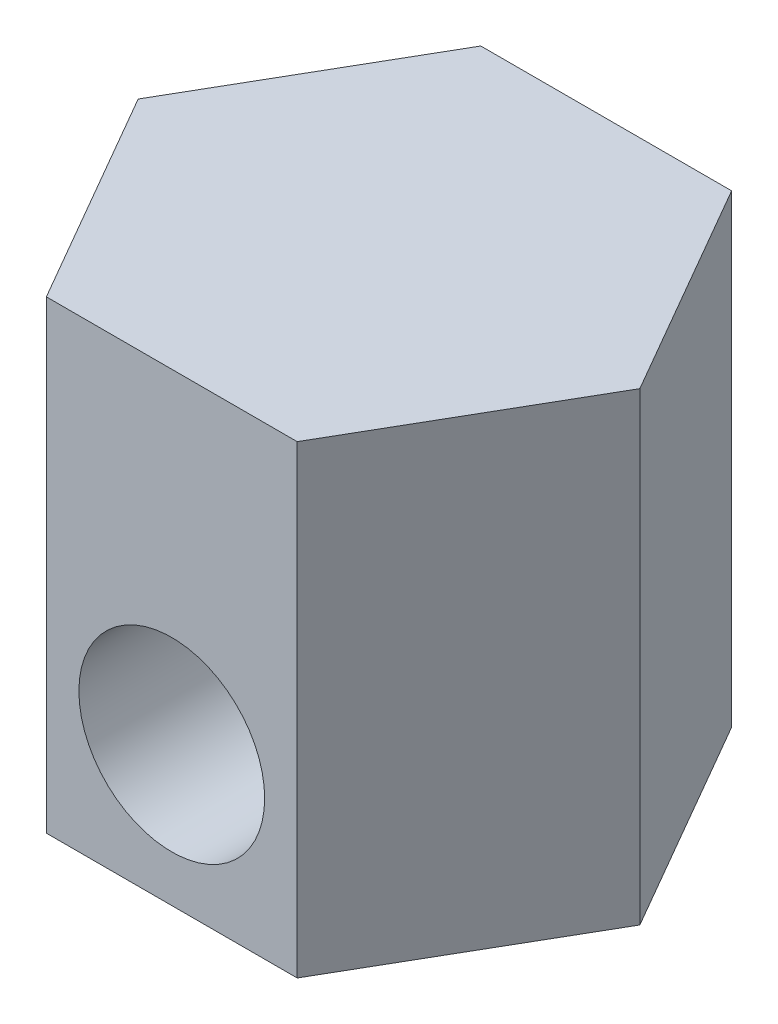
ISO-10303-21;
HEADER;
FILE_DESCRIPTION(('STEP AP214'),'2;1');
FILE_NAME('part.step','',(''),(''),'','','');
FILE_SCHEMA(('AUTOMOTIVE_DESIGN { 1 0 10303 214 1 1 1 1 }'));
ENDSEC;
DATA;
#1=APPLICATION_CONTEXT('core data for automotive mechanical design processes');
#2=APPLICATION_PROTOCOL_DEFINITION('international standard','automotive_design',2000,#1);
#3=PRODUCT_CONTEXT('',#1,'mechanical');
#4=PRODUCT('Part','Part','',(#3));
#5=PRODUCT_RELATED_PRODUCT_CATEGORY('part','',(#4));
#6=PRODUCT_DEFINITION_FORMATION('','',#4);
#7=PRODUCT_DEFINITION_CONTEXT('part definition',#1,'design');
#8=PRODUCT_DEFINITION('design','',#6,#7);
#9=PRODUCT_DEFINITION_SHAPE('','',#8);
#10=(LENGTH_UNIT() NAMED_UNIT(*) SI_UNIT(.MILLI.,.METRE.));
#11=(NAMED_UNIT(*) PLANE_ANGLE_UNIT() SI_UNIT($,.RADIAN.));
#12=(NAMED_UNIT(*) SI_UNIT($,.STERADIAN.) SOLID_ANGLE_UNIT());
#13=UNCERTAINTY_MEASURE_WITH_UNIT(LENGTH_MEASURE(1.E-05),#10,'distance_accuracy_value','');
#14=(GEOMETRIC_REPRESENTATION_CONTEXT(3) GLOBAL_UNCERTAINTY_ASSIGNED_CONTEXT((#13)) GLOBAL_UNIT_ASSIGNED_CONTEXT((#10,
#11,#12)) REPRESENTATION_CONTEXT('',''));
#15=CARTESIAN_POINT('',(0.,0.,0.));
#16=DIRECTION('',(0.,0.,1.));
#17=DIRECTION('',(1.,0.,0.));
#18=AXIS2_PLACEMENT_3D('',#15,#16,#17);
#19=CARTESIAN_POINT('',(0.,1.,-2.33826859021799));
#20=DIRECTION('',(0.,0.,1.));
#21=DIRECTION('',(1.,0.,0.));
#22=AXIS2_PLACEMENT_3D('',#19,#20,#21);
#23=CYLINDRICAL_SURFACE('',#22,0.5);
#24=CARTESIAN_POINT('',(0.,1.,-2.33826859021799));
#25=DIRECTION('',(0.,0.,1.));
#26=DIRECTION('',(1.,0.,0.));
#27=AXIS2_PLACEMENT_3D('',#24,#25,#26);
#28=CIRCLE('',#27,0.5);
#29=CARTESIAN_POINT('',(0.5,1.,-2.33826859021799));
#30=VERTEX_POINT('',#29);
#31=EDGE_CURVE('E128',#30,#30,#28,.T.);
#32=ORIENTED_EDGE('',*,*,#31,.F.);
#33=EDGE_LOOP('',(#32));
#34=FACE_BOUND('',#33,.T.);
#35=CARTESIAN_POINT('',(0.,1.,0.338268590217985));
#36=DIRECTION('',(0.,0.,1.));
#37=DIRECTION('',(1.,0.,0.));
#38=AXIS2_PLACEMENT_3D('',#35,#36,#37);
#39=CIRCLE('',#38,0.5);
#40=CARTESIAN_POINT('',(0.,0.5,0.338268590217985));
#41=VERTEX_POINT('',#40);
#42=EDGE_CURVE('E11',#41,#41,#39,.F.);
#43=ORIENTED_EDGE('',*,*,#42,.F.);
#44=EDGE_LOOP('',(#43));
#45=FACE_BOUND('',#44,.T.);
#46=ADVANCED_FACE('F33',(#34,#45),#23,.F.);
#47=CARTESIAN_POINT('',(1.35,5.,2.33826859021799));
#48=DIRECTION('',(-0.866025403784439,0.,-0.5));
#49=DIRECTION('',(-0.5,0.,0.866025403784439));
#50=AXIS2_PLACEMENT_3D('',#47,#48,#49);
#51=PLANE('',#50);
#52=DIRECTION('',(0.5,0.,-0.866025403784439));
#53=VECTOR('',#52,1.);
#54=CARTESIAN_POINT('',(1.35,0.,2.33826859021799));
#55=LINE('',#54,#53);
#56=CARTESIAN_POINT('',(1.35,0.,2.33826859021799));
#57=VERTEX_POINT('',#56);
#58=CARTESIAN_POINT('',(2.7,0.,0.));
#59=VERTEX_POINT('',#58);
#60=EDGE_CURVE('E124',#57,#59,#55,.T.);
#61=ORIENTED_EDGE('',*,*,#60,.T.);
#62=DIRECTION('',(0.,-1.,0.));
#63=VECTOR('',#62,1.);
#64=CARTESIAN_POINT('',(2.7,5.,0.));
#65=LINE('',#64,#63);
#66=CARTESIAN_POINT('',(2.7,5.,0.));
#67=VERTEX_POINT('',#66);
#68=EDGE_CURVE('E41',#67,#59,#65,.T.);
#69=ORIENTED_EDGE('',*,*,#68,.F.);
#70=DIRECTION('',(0.5,0.,-0.866025403784439));
#71=VECTOR('',#70,1.);
#72=CARTESIAN_POINT('',(1.35,5.,2.33826859021799));
#73=LINE('',#72,#71);
#74=CARTESIAN_POINT('',(1.35,5.,2.33826859021799));
#75=VERTEX_POINT('',#74);
#76=EDGE_CURVE('E136',#75,#67,#73,.T.);
#77=ORIENTED_EDGE('',*,*,#76,.F.);
#78=DIRECTION('',(0.,-1.,0.));
#79=VECTOR('',#78,1.);
#80=CARTESIAN_POINT('',(1.35,5.,2.33826859021799));
#81=LINE('',#80,#79);
#82=EDGE_CURVE('E120',#75,#57,#81,.T.);
#83=ORIENTED_EDGE('',*,*,#82,.T.);
#84=EDGE_LOOP('',(#61,#69,#77,#83));
#85=FACE_BOUND('',#84,.T.);
#86=ADVANCED_FACE('F35',(#85),#51,.F.);
#87=CARTESIAN_POINT('',(2.7,5.,0.));
#88=DIRECTION('',(-0.866025403784438,0.,0.5));
#89=DIRECTION('',(0.5,0.,0.866025403784439));
#90=AXIS2_PLACEMENT_3D('',#87,#88,#89);
#91=PLANE('',#90);
#92=DIRECTION('',(-0.5,0.,-0.866025403784439));
#93=VECTOR('',#92,1.);
#94=CARTESIAN_POINT('',(2.7,0.,0.));
#95=LINE('',#94,#93);
#96=CARTESIAN_POINT('',(1.35,0.,-2.33826859021798));
#97=VERTEX_POINT('',#96);
#98=EDGE_CURVE('E127',#59,#97,#95,.T.);
#99=ORIENTED_EDGE('',*,*,#98,.T.);
#100=DIRECTION('',(0.,-1.,0.));
#101=VECTOR('',#100,1.);
#102=CARTESIAN_POINT('',(1.35,5.,-2.33826859021798));
#103=LINE('',#102,#101);
#104=CARTESIAN_POINT('',(1.35,5.,-2.33826859021798));
#105=VERTEX_POINT('',#104);
#106=EDGE_CURVE('E140',#105,#97,#103,.T.);
#107=ORIENTED_EDGE('',*,*,#106,.F.);
#108=DIRECTION('',(-0.5,0.,-0.866025403784439));
#109=VECTOR('',#108,1.);
#110=CARTESIAN_POINT('',(2.7,5.,0.));
#111=LINE('',#110,#109);
#112=EDGE_CURVE('E89',#67,#105,#111,.T.);
#113=ORIENTED_EDGE('',*,*,#112,.F.);
#114=ORIENTED_EDGE('',*,*,#68,.T.);
#115=EDGE_LOOP('',(#99,#107,#113,#114));
#116=FACE_BOUND('',#115,.T.);
#117=ADVANCED_FACE('F143',(#116),#91,.F.);
#118=CARTESIAN_POINT('',(1.35,5.,-2.33826859021798));
#119=DIRECTION('',(0.,0.,1.));
#120=DIRECTION('',(1.,0.,0.));
#121=AXIS2_PLACEMENT_3D('',#118,#119,#120);
#122=PLANE('',#121);
#123=ORIENTED_EDGE('',*,*,#31,.T.);
#124=EDGE_LOOP('',(#123));
#125=FACE_BOUND('',#124,.T.);
#126=DIRECTION('',(-1.,0.,0.));
#127=VECTOR('',#126,1.);
#128=CARTESIAN_POINT('',(1.35,0.,-2.33826859021798));
#129=LINE('',#128,#127);
#130=CARTESIAN_POINT('',(-1.35,0.,-2.33826859021799));
#131=VERTEX_POINT('',#130);
#132=EDGE_CURVE('E130',#97,#131,#129,.T.);
#133=ORIENTED_EDGE('',*,*,#132,.T.);
#134=DIRECTION('',(0.,-1.,0.));
#135=VECTOR('',#134,1.);
#136=CARTESIAN_POINT('',(-1.35,5.,-2.33826859021799));
#137=LINE('',#136,#135);
#138=CARTESIAN_POINT('',(-1.35,5.,-2.33826859021799));
#139=VERTEX_POINT('',#138);
#140=EDGE_CURVE('E115',#139,#131,#137,.T.);
#141=ORIENTED_EDGE('',*,*,#140,.F.);
#142=DIRECTION('',(-1.,0.,0.));
#143=VECTOR('',#142,1.);
#144=CARTESIAN_POINT('',(1.35,5.,-2.33826859021798));
#145=LINE('',#144,#143);
#146=EDGE_CURVE('E103',#105,#139,#145,.T.);
#147=ORIENTED_EDGE('',*,*,#146,.F.);
#148=ORIENTED_EDGE('',*,*,#106,.T.);
#149=EDGE_LOOP('',(#133,#141,#147,#148));
#150=FACE_BOUND('',#149,.T.);
#151=ADVANCED_FACE('F151',(#125,#150),#122,.F.);
#152=CARTESIAN_POINT('',(-1.35,5.,-2.33826859021799));
#153=DIRECTION('',(0.866025403784439,0.,0.5));
#154=DIRECTION('',(0.5,0.,-0.866025403784439));
#155=AXIS2_PLACEMENT_3D('',#152,#153,#154);
#156=PLANE('',#155);
#157=DIRECTION('',(-0.5,0.,0.866025403784439));
#158=VECTOR('',#157,1.);
#159=CARTESIAN_POINT('',(-1.35,0.,-2.33826859021799));
#160=LINE('',#159,#158);
#161=CARTESIAN_POINT('',(-2.7,0.,0.));
#162=VERTEX_POINT('',#161);
#163=EDGE_CURVE('E112',#131,#162,#160,.T.);
#164=ORIENTED_EDGE('',*,*,#163,.T.);
#165=DIRECTION('',(0.,-1.,0.));
#166=VECTOR('',#165,1.);
#167=CARTESIAN_POINT('',(-2.7,5.,0.));
#168=LINE('',#167,#166);
#169=CARTESIAN_POINT('',(-2.7,5.,0.));
#170=VERTEX_POINT('',#169);
#171=EDGE_CURVE('E109',#170,#162,#168,.T.);
#172=ORIENTED_EDGE('',*,*,#171,.F.);
#173=DIRECTION('',(-0.5,0.,0.866025403784439));
#174=VECTOR('',#173,1.);
#175=CARTESIAN_POINT('',(-1.35,5.,-2.33826859021799));
#176=LINE('',#175,#174);
#177=EDGE_CURVE('E96',#139,#170,#176,.T.);
#178=ORIENTED_EDGE('',*,*,#177,.F.);
#179=ORIENTED_EDGE('',*,*,#140,.T.);
#180=EDGE_LOOP('',(#164,#172,#178,#179));
#181=FACE_BOUND('',#180,.T.);
#182=ADVANCED_FACE('F110',(#181),#156,.F.);
#183=CARTESIAN_POINT('',(-2.7,5.,0.));
#184=DIRECTION('',(0.866025403784439,0.,-0.5));
#185=DIRECTION('',(-0.5,0.,-0.866025403784439));
#186=AXIS2_PLACEMENT_3D('',#183,#184,#185);
#187=PLANE('',#186);
#188=DIRECTION('',(0.5,0.,0.866025403784438));
#189=VECTOR('',#188,1.);
#190=CARTESIAN_POINT('',(-2.7,0.,0.));
#191=LINE('',#190,#189);
#192=CARTESIAN_POINT('',(-1.35,0.,2.33826859021799));
#193=VERTEX_POINT('',#192);
#194=EDGE_CURVE('E133',#162,#193,#191,.T.);
#195=ORIENTED_EDGE('',*,*,#194,.T.);
#196=DIRECTION('',(0.,-1.,0.));
#197=VECTOR('',#196,1.);
#198=CARTESIAN_POINT('',(-1.35,5.,2.33826859021799));
#199=LINE('',#198,#197);
#200=CARTESIAN_POINT('',(-1.35,5.,2.33826859021799));
#201=VERTEX_POINT('',#200);
#202=EDGE_CURVE('E116',#201,#193,#199,.T.);
#203=ORIENTED_EDGE('',*,*,#202,.F.);
#204=DIRECTION('',(0.5,0.,0.866025403784438));
#205=VECTOR('',#204,1.);
#206=CARTESIAN_POINT('',(-2.7,5.,0.));
#207=LINE('',#206,#205);
#208=EDGE_CURVE('E100',#170,#201,#207,.T.);
#209=ORIENTED_EDGE('',*,*,#208,.F.);
#210=ORIENTED_EDGE('',*,*,#171,.T.);
#211=EDGE_LOOP('',(#195,#203,#209,#210));
#212=FACE_BOUND('',#211,.T.);
#213=ADVANCED_FACE('F118',(#212),#187,.F.);
#214=CARTESIAN_POINT('',(-1.35,5.,2.33826859021799));
#215=DIRECTION('',(0.,0.,-1.));
#216=DIRECTION('',(-1.,0.,0.));
#217=AXIS2_PLACEMENT_3D('',#214,#215,#216);
#218=PLANE('',#217);
#219=CARTESIAN_POINT('',(0.,1.5,2.33826859021799));
#220=DIRECTION('',(0.,0.,1.));
#221=DIRECTION('',(1.,0.,0.));
#222=AXIS2_PLACEMENT_3D('',#219,#220,#221);
#223=CIRCLE('',#222,1.);
#224=CARTESIAN_POINT('',(1.,1.5,2.33826859021799));
#225=VERTEX_POINT('',#224);
#226=EDGE_CURVE('E157',#225,#225,#223,.T.);
#227=ORIENTED_EDGE('',*,*,#226,.F.);
#228=EDGE_LOOP('',(#227));
#229=FACE_BOUND('',#228,.T.);
#230=DIRECTION('',(1.,0.,0.));
#231=VECTOR('',#230,1.);
#232=CARTESIAN_POINT('',(-1.35,0.,2.33826859021799));
#233=LINE('',#232,#231);
#234=EDGE_CURVE('E80',#193,#57,#233,.T.);
#235=ORIENTED_EDGE('',*,*,#234,.T.);
#236=ORIENTED_EDGE('',*,*,#82,.F.);
#237=DIRECTION('',(1.,0.,0.));
#238=VECTOR('',#237,1.);
#239=CARTESIAN_POINT('',(-1.35,5.,2.33826859021799));
#240=LINE('',#239,#238);
#241=EDGE_CURVE('E54',#201,#75,#240,.T.);
#242=ORIENTED_EDGE('',*,*,#241,.F.);
#243=ORIENTED_EDGE('',*,*,#202,.T.);
#244=EDGE_LOOP('',(#235,#236,#242,#243));
#245=FACE_BOUND('',#244,.T.);
#246=ADVANCED_FACE('F177',(#229,#245),#218,.F.);
#247=CARTESIAN_POINT('',(0.,5.,0.));
#248=DIRECTION('',(0.,1.,0.));
#249=DIRECTION('',(0.,0.,1.));
#250=AXIS2_PLACEMENT_3D('',#247,#248,#249);
#251=PLANE('',#250);
#252=ORIENTED_EDGE('',*,*,#76,.T.);
#253=ORIENTED_EDGE('',*,*,#112,.T.);
#254=ORIENTED_EDGE('',*,*,#146,.T.);
#255=ORIENTED_EDGE('',*,*,#177,.T.);
#256=ORIENTED_EDGE('',*,*,#208,.T.);
#257=ORIENTED_EDGE('',*,*,#241,.T.);
#258=EDGE_LOOP('',(#252,#253,#254,#255,#256,#257));
#259=FACE_BOUND('',#258,.T.);
#260=ADVANCED_FACE('F98',(#259),#251,.T.);
#261=CARTESIAN_POINT('',(0.,0.,0.));
#262=DIRECTION('',(0.,1.,0.));
#263=DIRECTION('',(0.,0.,1.));
#264=AXIS2_PLACEMENT_3D('',#261,#262,#263);
#265=PLANE('',#264);
#266=ORIENTED_EDGE('',*,*,#60,.F.);
#267=ORIENTED_EDGE('',*,*,#234,.F.);
#268=ORIENTED_EDGE('',*,*,#194,.F.);
#269=ORIENTED_EDGE('',*,*,#163,.F.);
#270=ORIENTED_EDGE('',*,*,#132,.F.);
#271=ORIENTED_EDGE('',*,*,#98,.F.);
#272=EDGE_LOOP('',(#266,#267,#268,#269,#270,#271));
#273=FACE_BOUND('',#272,.T.);
#274=ADVANCED_FACE('F148',(#273),#265,.F.);
#275=CARTESIAN_POINT('',(0.,1.5,0.338268590217985));
#276=DIRECTION('',(0.,0.,1.));
#277=DIRECTION('',(1.,0.,0.));
#278=AXIS2_PLACEMENT_3D('',#275,#276,#277);
#279=PLANE('',#278);
#280=CARTESIAN_POINT('',(0.,1.5,0.338268590217985));
#281=DIRECTION('',(0.,0.,1.));
#282=DIRECTION('',(1.,0.,0.));
#283=AXIS2_PLACEMENT_3D('',#280,#281,#282);
#284=CIRCLE('',#283,1.);
#285=EDGE_CURVE('E46',#41,#41,#284,.T.);
#286=ORIENTED_EDGE('',*,*,#285,.T.);
#287=ORIENTED_EDGE('',*,*,#42,.T.);
#288=EDGE_LOOP('',(#286,#287));
#289=FACE_BOUND('',#288,.T.);
#290=ADVANCED_FACE('F161',(#289),#279,.T.);
#291=CARTESIAN_POINT('',(0.,1.5,0.338268590217985));
#292=DIRECTION('',(0.,0.,1.));
#293=DIRECTION('',(1.,0.,0.));
#294=AXIS2_PLACEMENT_3D('',#291,#292,#293);
#295=CYLINDRICAL_SURFACE('',#294,1.);
#296=ORIENTED_EDGE('',*,*,#226,.T.);
#297=EDGE_LOOP('',(#296));
#298=FACE_BOUND('',#297,.T.);
#299=ORIENTED_EDGE('',*,*,#285,.F.);
#300=EDGE_LOOP('',(#299));
#301=FACE_BOUND('',#300,.T.);
#302=ADVANCED_FACE('F173',(#298,#301),#295,.F.);
#303=CLOSED_SHELL('',(#46,#86,#117,#151,#182,#213,#246,#260,#274,#290,#302));
#304=MANIFOLD_SOLID_BREP('B2',#303);
#305=ADVANCED_BREP_SHAPE_REPRESENTATION('',(#18,#304),#14);
#306=SHAPE_DEFINITION_REPRESENTATION(#9,#305);
ENDSEC;
END-ISO-10303-21;
